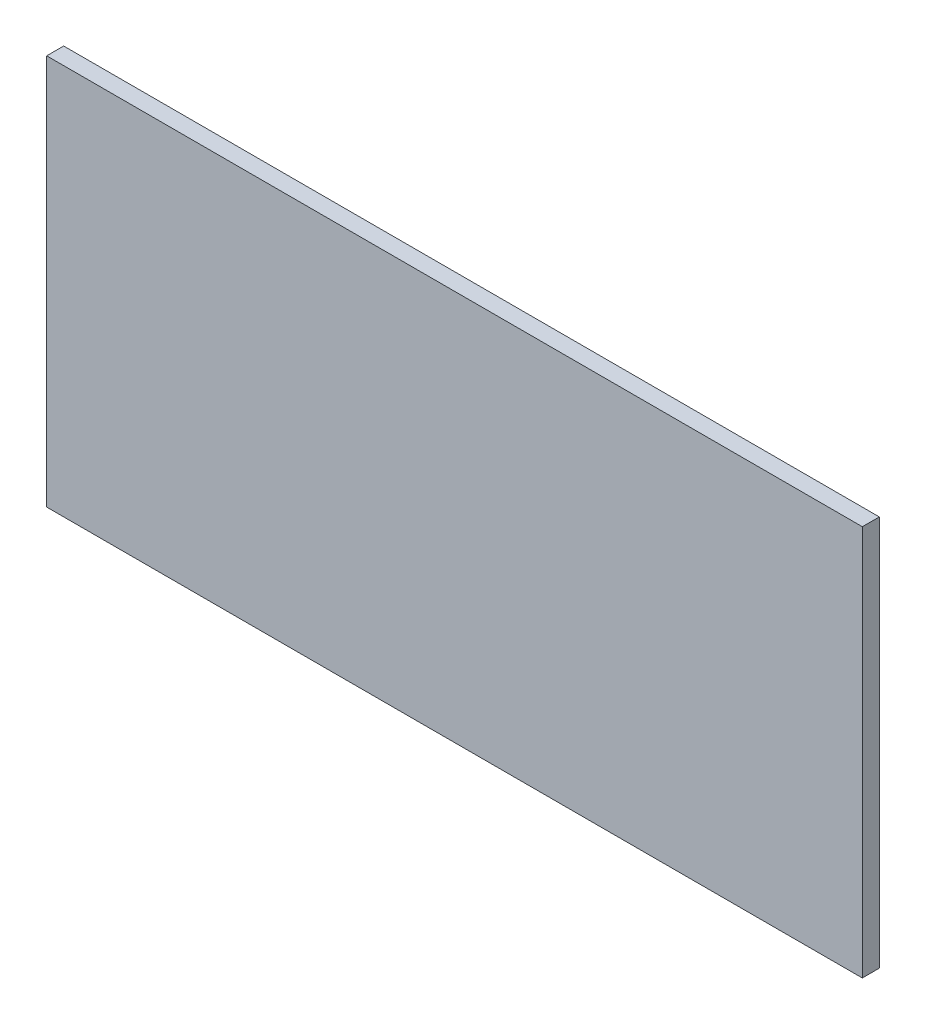
ISO-10303-21;
HEADER;
FILE_DESCRIPTION(('STEP AP214'),'2;1');
FILE_NAME('part.step','',(''),(''),'','','');
FILE_SCHEMA(('AUTOMOTIVE_DESIGN { 1 0 10303 214 1 1 1 1 }'));
ENDSEC;
DATA;
#1=APPLICATION_CONTEXT('core data for automotive mechanical design processes');
#2=APPLICATION_PROTOCOL_DEFINITION('international standard','automotive_design',2000,#1);
#3=PRODUCT_CONTEXT('',#1,'mechanical');
#4=PRODUCT('Part','Part','',(#3));
#5=PRODUCT_RELATED_PRODUCT_CATEGORY('part','',(#4));
#6=PRODUCT_DEFINITION_FORMATION('','',#4);
#7=PRODUCT_DEFINITION_CONTEXT('part definition',#1,'design');
#8=PRODUCT_DEFINITION('design','',#6,#7);
#9=PRODUCT_DEFINITION_SHAPE('','',#8);
#10=(LENGTH_UNIT() NAMED_UNIT(*) SI_UNIT(.MILLI.,.METRE.));
#11=(NAMED_UNIT(*) PLANE_ANGLE_UNIT() SI_UNIT($,.RADIAN.));
#12=(NAMED_UNIT(*) SI_UNIT($,.STERADIAN.) SOLID_ANGLE_UNIT());
#13=UNCERTAINTY_MEASURE_WITH_UNIT(LENGTH_MEASURE(1.E-05),#10,'distance_accuracy_value','');
#14=(GEOMETRIC_REPRESENTATION_CONTEXT(3) GLOBAL_UNCERTAINTY_ASSIGNED_CONTEXT((#13)) GLOBAL_UNIT_ASSIGNED_CONTEXT((#10,
#11,#12)) REPRESENTATION_CONTEXT('',''));
#15=CARTESIAN_POINT('',(0.,0.,0.));
#16=DIRECTION('',(0.,0.,1.));
#17=DIRECTION('',(1.,0.,0.));
#18=AXIS2_PLACEMENT_3D('',#15,#16,#17);
#19=CARTESIAN_POINT('',(0.,0.,12.7));
#20=DIRECTION('',(1.,0.,0.));
#21=DIRECTION('',(0.,0.,-1.));
#22=AXIS2_PLACEMENT_3D('',#19,#20,#21);
#23=PLANE('',#22);
#24=DIRECTION('',(0.,-1.,0.));
#25=VECTOR('',#24,1.);
#26=CARTESIAN_POINT('',(0.,0.,0.));
#27=LINE('',#26,#25);
#28=CARTESIAN_POINT('',(0.,292.1,0.));
#29=VERTEX_POINT('',#28);
#30=CARTESIAN_POINT('',(0.,0.,0.));
#31=VERTEX_POINT('',#30);
#32=EDGE_CURVE('E111',#29,#31,#27,.T.);
#33=ORIENTED_EDGE('',*,*,#32,.T.);
#34=DIRECTION('',(0.,0.,-1.));
#35=VECTOR('',#34,1.);
#36=CARTESIAN_POINT('',(0.,0.,12.7));
#37=LINE('',#36,#35);
#38=CARTESIAN_POINT('',(0.,0.,12.7));
#39=VERTEX_POINT('',#38);
#40=EDGE_CURVE('E11',#39,#31,#37,.T.);
#41=ORIENTED_EDGE('',*,*,#40,.F.);
#42=DIRECTION('',(0.,-1.,0.));
#43=VECTOR('',#42,1.);
#44=CARTESIAN_POINT('',(0.,0.,12.7));
#45=LINE('',#44,#43);
#46=CARTESIAN_POINT('',(0.,292.1,12.7));
#47=VERTEX_POINT('',#46);
#48=EDGE_CURVE('E95',#47,#39,#45,.T.);
#49=ORIENTED_EDGE('',*,*,#48,.F.);
#50=DIRECTION('',(0.,0.,-1.));
#51=VECTOR('',#50,1.);
#52=CARTESIAN_POINT('',(0.,292.1,12.7));
#53=LINE('',#52,#51);
#54=EDGE_CURVE('E107',#47,#29,#53,.T.);
#55=ORIENTED_EDGE('',*,*,#54,.T.);
#56=EDGE_LOOP('',(#33,#41,#49,#55));
#57=FACE_BOUND('',#56,.T.);
#58=ADVANCED_FACE('F43',(#57),#23,.F.);
#59=CARTESIAN_POINT('',(0.,0.,12.7));
#60=DIRECTION('',(0.,1.,0.));
#61=DIRECTION('',(0.,0.,1.));
#62=AXIS2_PLACEMENT_3D('',#59,#60,#61);
#63=PLANE('',#62);
#64=DIRECTION('',(1.,0.,0.));
#65=VECTOR('',#64,1.);
#66=CARTESIAN_POINT('',(0.,0.,0.));
#67=LINE('',#66,#65);
#68=CARTESIAN_POINT('',(609.6,0.,0.));
#69=VERTEX_POINT('',#68);
#70=EDGE_CURVE('E100',#31,#69,#67,.T.);
#71=ORIENTED_EDGE('',*,*,#70,.T.);
#72=DIRECTION('',(0.,0.,-1.));
#73=VECTOR('',#72,1.);
#74=CARTESIAN_POINT('',(609.6,0.,12.7));
#75=LINE('',#74,#73);
#76=CARTESIAN_POINT('',(609.6,0.,12.7));
#77=VERTEX_POINT('',#76);
#78=EDGE_CURVE('E52',#77,#69,#75,.T.);
#79=ORIENTED_EDGE('',*,*,#78,.F.);
#80=DIRECTION('',(1.,0.,0.));
#81=VECTOR('',#80,1.);
#82=CARTESIAN_POINT('',(0.,0.,12.7));
#83=LINE('',#82,#81);
#84=EDGE_CURVE('E90',#39,#77,#83,.T.);
#85=ORIENTED_EDGE('',*,*,#84,.F.);
#86=ORIENTED_EDGE('',*,*,#40,.T.);
#87=EDGE_LOOP('',(#71,#79,#85,#86));
#88=FACE_BOUND('',#87,.T.);
#89=ADVANCED_FACE('F99',(#88),#63,.F.);
#90=CARTESIAN_POINT('',(609.6,0.,12.7));
#91=DIRECTION('',(-1.,0.,0.));
#92=DIRECTION('',(0.,0.,1.));
#93=AXIS2_PLACEMENT_3D('',#90,#91,#92);
#94=PLANE('',#93);
#95=DIRECTION('',(0.,1.,0.));
#96=VECTOR('',#95,1.);
#97=CARTESIAN_POINT('',(609.6,0.,0.));
#98=LINE('',#97,#96);
#99=CARTESIAN_POINT('',(609.6,292.1,0.));
#100=VERTEX_POINT('',#99);
#101=EDGE_CURVE('E77',#69,#100,#98,.T.);
#102=ORIENTED_EDGE('',*,*,#101,.T.);
#103=DIRECTION('',(0.,0.,-1.));
#104=VECTOR('',#103,1.);
#105=CARTESIAN_POINT('',(609.6,292.1,12.7));
#106=LINE('',#105,#104);
#107=CARTESIAN_POINT('',(609.6,292.1,12.7));
#108=VERTEX_POINT('',#107);
#109=EDGE_CURVE('E102',#108,#100,#106,.T.);
#110=ORIENTED_EDGE('',*,*,#109,.F.);
#111=DIRECTION('',(0.,1.,0.));
#112=VECTOR('',#111,1.);
#113=CARTESIAN_POINT('',(609.6,0.,12.7));
#114=LINE('',#113,#112);
#115=EDGE_CURVE('E93',#77,#108,#114,.T.);
#116=ORIENTED_EDGE('',*,*,#115,.F.);
#117=ORIENTED_EDGE('',*,*,#78,.T.);
#118=EDGE_LOOP('',(#102,#110,#116,#117));
#119=FACE_BOUND('',#118,.T.);
#120=ADVANCED_FACE('F103',(#119),#94,.F.);
#121=CARTESIAN_POINT('',(0.,292.1,12.7));
#122=DIRECTION('',(0.,-1.,0.));
#123=DIRECTION('',(0.,0.,-1.));
#124=AXIS2_PLACEMENT_3D('',#121,#122,#123);
#125=PLANE('',#124);
#126=DIRECTION('',(-1.,0.,0.));
#127=VECTOR('',#126,1.);
#128=CARTESIAN_POINT('',(0.,292.1,0.));
#129=LINE('',#128,#127);
#130=EDGE_CURVE('E83',#100,#29,#129,.T.);
#131=ORIENTED_EDGE('',*,*,#130,.T.);
#132=ORIENTED_EDGE('',*,*,#54,.F.);
#133=DIRECTION('',(-1.,0.,0.));
#134=VECTOR('',#133,1.);
#135=CARTESIAN_POINT('',(0.,292.1,12.7));
#136=LINE('',#135,#134);
#137=EDGE_CURVE('E60',#108,#47,#136,.T.);
#138=ORIENTED_EDGE('',*,*,#137,.F.);
#139=ORIENTED_EDGE('',*,*,#109,.T.);
#140=EDGE_LOOP('',(#131,#132,#138,#139));
#141=FACE_BOUND('',#140,.T.);
#142=ADVANCED_FACE('F124',(#141),#125,.F.);
#143=CARTESIAN_POINT('',(0.,0.,12.7));
#144=DIRECTION('',(0.,0.,-1.));
#145=DIRECTION('',(-1.,0.,0.));
#146=AXIS2_PLACEMENT_3D('',#143,#144,#145);
#147=PLANE('',#146);
#148=ORIENTED_EDGE('',*,*,#48,.T.);
#149=ORIENTED_EDGE('',*,*,#84,.T.);
#150=ORIENTED_EDGE('',*,*,#115,.T.);
#151=ORIENTED_EDGE('',*,*,#137,.T.);
#152=EDGE_LOOP('',(#148,#149,#150,#151));
#153=FACE_BOUND('',#152,.T.);
#154=ADVANCED_FACE('F91',(#153),#147,.F.);
#155=CARTESIAN_POINT('',(0.,0.,0.));
#156=DIRECTION('',(0.,0.,-1.));
#157=DIRECTION('',(-1.,0.,0.));
#158=AXIS2_PLACEMENT_3D('',#155,#156,#157);
#159=PLANE('',#158);
#160=ORIENTED_EDGE('',*,*,#32,.F.);
#161=ORIENTED_EDGE('',*,*,#130,.F.);
#162=ORIENTED_EDGE('',*,*,#101,.F.);
#163=ORIENTED_EDGE('',*,*,#70,.F.);
#164=EDGE_LOOP('',(#160,#161,#162,#163));
#165=FACE_BOUND('',#164,.T.);
#166=ADVANCED_FACE('F127',(#165),#159,.T.);
#167=CLOSED_SHELL('',(#58,#89,#120,#142,#154,#166));
#168=MANIFOLD_SOLID_BREP('B2',#167);
#169=ADVANCED_BREP_SHAPE_REPRESENTATION('',(#18,#168),#14);
#170=SHAPE_DEFINITION_REPRESENTATION(#9,#169);
ENDSEC;
END-ISO-10303-21;
